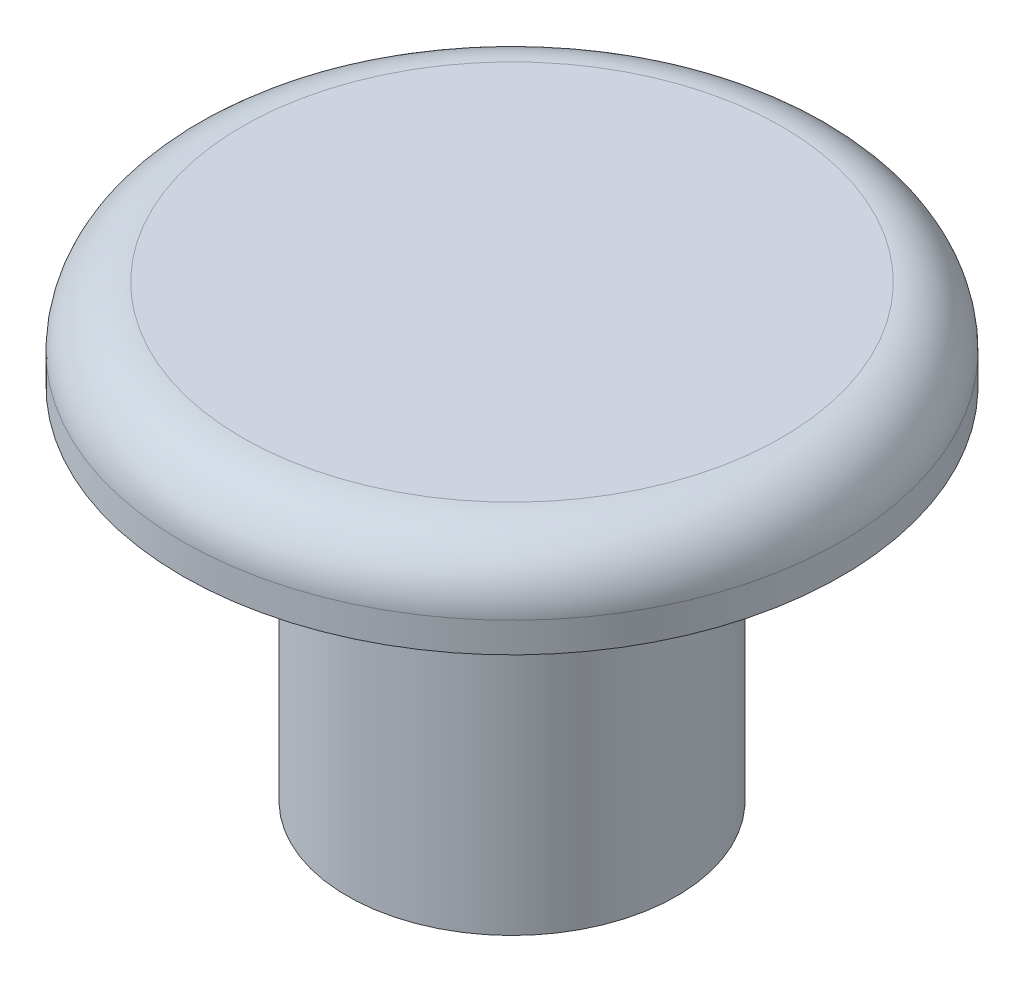
ISO-10303-21;
HEADER;
FILE_DESCRIPTION(('STEP AP214'),'2;1');
FILE_NAME('part.step','',(''),(''),'','','');
FILE_SCHEMA(('AUTOMOTIVE_DESIGN { 1 0 10303 214 1 1 1 1 }'));
ENDSEC;
DATA;
#1=APPLICATION_CONTEXT('core data for automotive mechanical design processes');
#2=APPLICATION_PROTOCOL_DEFINITION('international standard','automotive_design',2000,#1);
#3=PRODUCT_CONTEXT('',#1,'mechanical');
#4=PRODUCT('Part','Part','',(#3));
#5=PRODUCT_RELATED_PRODUCT_CATEGORY('part','',(#4));
#6=PRODUCT_DEFINITION_FORMATION('','',#4);
#7=PRODUCT_DEFINITION_CONTEXT('part definition',#1,'design');
#8=PRODUCT_DEFINITION('design','',#6,#7);
#9=PRODUCT_DEFINITION_SHAPE('','',#8);
#10=(LENGTH_UNIT() NAMED_UNIT(*) SI_UNIT(.MILLI.,.METRE.));
#11=(NAMED_UNIT(*) PLANE_ANGLE_UNIT() SI_UNIT($,.RADIAN.));
#12=(NAMED_UNIT(*) SI_UNIT($,.STERADIAN.) SOLID_ANGLE_UNIT());
#13=UNCERTAINTY_MEASURE_WITH_UNIT(LENGTH_MEASURE(1.E-05),#10,'distance_accuracy_value','');
#14=(GEOMETRIC_REPRESENTATION_CONTEXT(3) GLOBAL_UNCERTAINTY_ASSIGNED_CONTEXT((#13)) GLOBAL_UNIT_ASSIGNED_CONTEXT((#10,
#11,#12)) REPRESENTATION_CONTEXT('',''));
#15=CARTESIAN_POINT('',(0.,0.,0.));
#16=DIRECTION('',(0.,0.,1.));
#17=DIRECTION('',(1.,0.,0.));
#18=AXIS2_PLACEMENT_3D('',#15,#16,#17);
#19=CARTESIAN_POINT('',(0.,0.,0.));
#20=DIRECTION('',(0.,-1.,0.));
#21=DIRECTION('',(0.,0.,-1.));
#22=AXIS2_PLACEMENT_3D('',#19,#20,#21);
#23=PLANE('',#22);
#24=CARTESIAN_POINT('',(0.,0.,0.));
#25=DIRECTION('',(0.,-1.,0.));
#26=DIRECTION('',(0.,0.,-1.));
#27=AXIS2_PLACEMENT_3D('',#24,#25,#26);
#28=CIRCLE('',#27,5.5);
#29=CARTESIAN_POINT('',(0.,0.,-5.5));
#30=VERTEX_POINT('',#29);
#31=EDGE_CURVE('E46',#30,#30,#28,.T.);
#32=ORIENTED_EDGE('',*,*,#31,.T.);
#33=EDGE_LOOP('',(#32));
#34=FACE_BOUND('',#33,.T.);
#35=ADVANCED_FACE('F35',(#34),#23,.T.);
#36=CARTESIAN_POINT('',(0.,0.,0.));
#37=DIRECTION('',(0.,-1.,0.));
#38=DIRECTION('',(0.,0.,-1.));
#39=AXIS2_PLACEMENT_3D('',#36,#37,#38);
#40=CYLINDRICAL_SURFACE('',#39,5.5);
#41=CARTESIAN_POINT('',(0.,12.,0.));
#42=DIRECTION('',(0.,-1.,0.));
#43=DIRECTION('',(0.,0.,-1.));
#44=AXIS2_PLACEMENT_3D('',#41,#42,#43);
#45=CIRCLE('',#44,5.5);
#46=CARTESIAN_POINT('',(0.,12.,-5.5));
#47=VERTEX_POINT('',#46);
#48=EDGE_CURVE('E50',#47,#47,#45,.T.);
#49=ORIENTED_EDGE('',*,*,#48,.T.);
#50=EDGE_LOOP('',(#49));
#51=FACE_BOUND('',#50,.T.);
#52=ORIENTED_EDGE('',*,*,#31,.F.);
#53=EDGE_LOOP('',(#52));
#54=FACE_BOUND('',#53,.T.);
#55=ADVANCED_FACE('F71',(#51,#54),#40,.T.);
#56=CARTESIAN_POINT('',(5.5,12.,0.));
#57=DIRECTION('',(0.,-1.,0.));
#58=DIRECTION('',(0.,0.,-1.));
#59=AXIS2_PLACEMENT_3D('',#56,#57,#58);
#60=PLANE('',#59);
#61=CARTESIAN_POINT('',(0.,12.,0.));
#62=DIRECTION('',(0.,-1.,0.));
#63=DIRECTION('',(0.,0.,-1.));
#64=AXIS2_PLACEMENT_3D('',#61,#62,#63);
#65=CIRCLE('',#64,11.);
#66=CARTESIAN_POINT('',(0.,12.,-11.));
#67=VERTEX_POINT('',#66);
#68=EDGE_CURVE('E55',#67,#67,#65,.T.);
#69=ORIENTED_EDGE('',*,*,#68,.T.);
#70=EDGE_LOOP('',(#69));
#71=FACE_BOUND('',#70,.T.);
#72=ORIENTED_EDGE('',*,*,#48,.F.);
#73=EDGE_LOOP('',(#72));
#74=FACE_BOUND('',#73,.T.);
#75=ADVANCED_FACE('F59',(#71,#74),#60,.T.);
#76=CARTESIAN_POINT('',(0.,0.,0.));
#77=DIRECTION('',(0.,-1.,0.));
#78=DIRECTION('',(0.,0.,-1.));
#79=AXIS2_PLACEMENT_3D('',#76,#77,#78);
#80=CYLINDRICAL_SURFACE('',#79,11.);
#81=CARTESIAN_POINT('',(0.,13.,0.));
#82=DIRECTION('',(0.,1.,0.));
#83=DIRECTION('',(0.,0.,1.));
#84=AXIS2_PLACEMENT_3D('',#81,#82,#83);
#85=CIRCLE('',#84,11.);
#86=CARTESIAN_POINT('',(0.,13.,11.));
#87=VERTEX_POINT('',#86);
#88=EDGE_CURVE('E42',#87,#87,#85,.F.);
#89=ORIENTED_EDGE('',*,*,#88,.T.);
#90=EDGE_LOOP('',(#89));
#91=FACE_BOUND('',#90,.T.);
#92=ORIENTED_EDGE('',*,*,#68,.F.);
#93=EDGE_LOOP('',(#92));
#94=FACE_BOUND('',#93,.T.);
#95=ADVANCED_FACE('F62',(#91,#94),#80,.T.);
#96=CARTESIAN_POINT('',(11.,15.,0.));
#97=DIRECTION('',(0.,1.,0.));
#98=DIRECTION('',(0.,0.,1.));
#99=AXIS2_PLACEMENT_3D('',#96,#97,#98);
#100=PLANE('',#99);
#101=CARTESIAN_POINT('',(0.,15.,0.));
#102=DIRECTION('',(0.,1.,0.));
#103=DIRECTION('',(0.,0.,1.));
#104=AXIS2_PLACEMENT_3D('',#101,#102,#103);
#105=CIRCLE('',#104,9.);
#106=CARTESIAN_POINT('',(0.,15.,9.));
#107=VERTEX_POINT('',#106);
#108=EDGE_CURVE('E10',#107,#107,#105,.T.);
#109=ORIENTED_EDGE('',*,*,#108,.T.);
#110=EDGE_LOOP('',(#109));
#111=FACE_BOUND('',#110,.T.);
#112=ADVANCED_FACE('F64',(#111),#100,.T.);
#113=CARTESIAN_POINT('',(0.,13.,0.));
#114=DIRECTION('',(0.,1.,0.));
#115=DIRECTION('',(0.,0.,1.));
#116=AXIS2_PLACEMENT_3D('',#113,#114,#115);
#117=TOROIDAL_SURFACE('',#116,9.,2.);
#118=ORIENTED_EDGE('',*,*,#108,.F.);
#119=EDGE_LOOP('',(#118));
#120=FACE_BOUND('',#119,.T.);
#121=ORIENTED_EDGE('',*,*,#88,.F.);
#122=EDGE_LOOP('',(#121));
#123=FACE_BOUND('',#122,.T.);
#124=ADVANCED_FACE('F37',(#120,#123),#117,.T.);
#125=CLOSED_SHELL('',(#35,#55,#75,#95,#112,#124));
#126=MANIFOLD_SOLID_BREP('B2',#125);
#127=ADVANCED_BREP_SHAPE_REPRESENTATION('',(#18,#126),#14);
#128=SHAPE_DEFINITION_REPRESENTATION(#9,#127);
ENDSEC;
END-ISO-10303-21;
